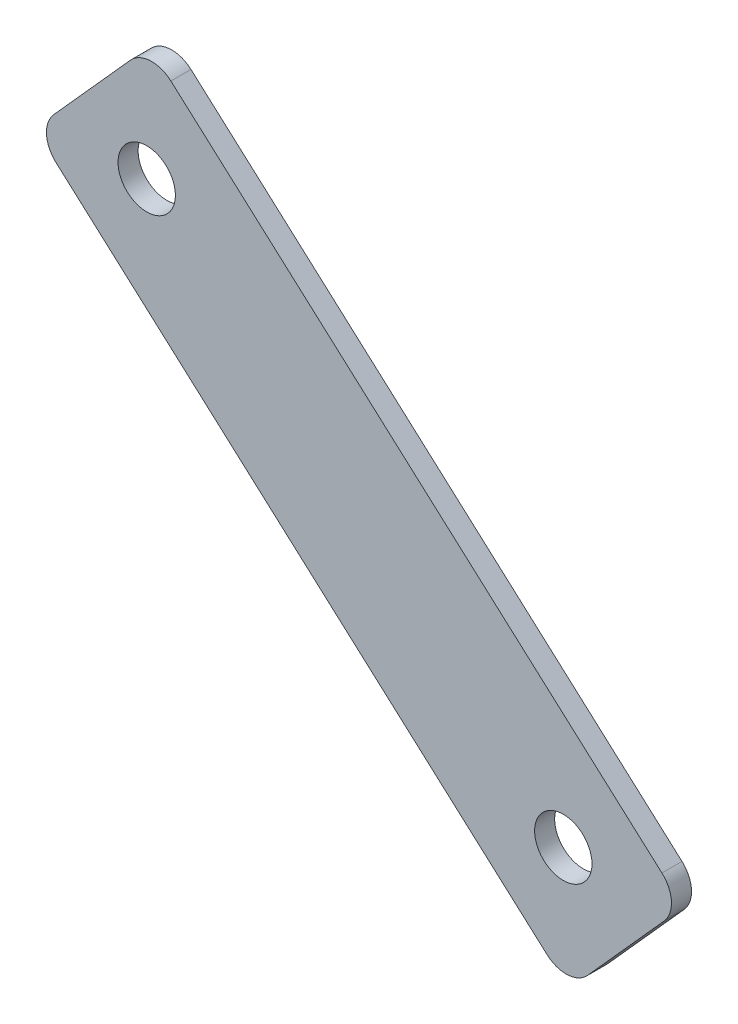
ISO-10303-21;
HEADER;
FILE_DESCRIPTION(('STEP AP214'),'2;1');
FILE_NAME('part.step','',(''),(''),'','','');
FILE_SCHEMA(('AUTOMOTIVE_DESIGN { 1 0 10303 214 1 1 1 1 }'));
ENDSEC;
DATA;
#1=APPLICATION_CONTEXT('core data for automotive mechanical design processes');
#2=APPLICATION_PROTOCOL_DEFINITION('international standard','automotive_design',2000,#1);
#3=PRODUCT_CONTEXT('',#1,'mechanical');
#4=PRODUCT('Part','Part','',(#3));
#5=PRODUCT_RELATED_PRODUCT_CATEGORY('part','',(#4));
#6=PRODUCT_DEFINITION_FORMATION('','',#4);
#7=PRODUCT_DEFINITION_CONTEXT('part definition',#1,'design');
#8=PRODUCT_DEFINITION('design','',#6,#7);
#9=PRODUCT_DEFINITION_SHAPE('','',#8);
#10=(LENGTH_UNIT() NAMED_UNIT(*) SI_UNIT(.MILLI.,.METRE.));
#11=(NAMED_UNIT(*) PLANE_ANGLE_UNIT() SI_UNIT($,.RADIAN.));
#12=(NAMED_UNIT(*) SI_UNIT($,.STERADIAN.) SOLID_ANGLE_UNIT());
#13=UNCERTAINTY_MEASURE_WITH_UNIT(LENGTH_MEASURE(1.E-05),#10,'distance_accuracy_value','');
#14=(GEOMETRIC_REPRESENTATION_CONTEXT(3) GLOBAL_UNCERTAINTY_ASSIGNED_CONTEXT((#13)) GLOBAL_UNIT_ASSIGNED_CONTEXT((#10,
#11,#12)) REPRESENTATION_CONTEXT('',''));
#15=CARTESIAN_POINT('',(0.,0.,0.));
#16=DIRECTION('',(0.,0.,1.));
#17=DIRECTION('',(1.,0.,0.));
#18=AXIS2_PLACEMENT_3D('',#15,#16,#17);
#19=CARTESIAN_POINT('',(-43.7818529659126,63.4547708478243,4.9));
#20=DIRECTION('',(0.667646304647423,0.744478617483833,0.));
#21=DIRECTION('',(-0.744478617483833,0.667646304647423,0.));
#22=AXIS2_PLACEMENT_3D('',#19,#20,#21);
#23=PLANE('',#22);
#24=DIRECTION('',(0.744478617483833,-0.667646304647423,0.));
#25=VECTOR('',#24,1.);
#26=CARTESIAN_POINT('',(-43.7818529659126,63.4547708478243,2.1));
#27=LINE('',#26,#25);
#28=CARTESIAN_POINT('',(-115.251800244361,127.548816093977,2.1));
#29=VERTEX_POINT('',#28);
#30=CARTESIAN_POINT('',(-46.759767435848,66.125356066414,2.1));
#31=VERTEX_POINT('',#30);
#32=EDGE_CURVE('E138',#29,#31,#27,.T.);
#33=ORIENTED_EDGE('',*,*,#32,.T.);
#34=DIRECTION('',(0.,0.,-1.));
#35=VECTOR('',#34,1.);
#36=CARTESIAN_POINT('',(-46.759767435848,66.125356066414,4.9));
#37=LINE('',#36,#35);
#38=CARTESIAN_POINT('',(-46.759767435848,66.125356066414,4.9));
#39=VERTEX_POINT('',#38);
#40=EDGE_CURVE('E113',#31,#39,#37,.F.);
#41=ORIENTED_EDGE('',*,*,#40,.T.);
#42=DIRECTION('',(0.744478617483833,-0.667646304647423,0.));
#43=VECTOR('',#42,1.);
#44=CARTESIAN_POINT('',(-43.7818529659126,63.4547708478243,4.9));
#45=LINE('',#44,#43);
#46=CARTESIAN_POINT('',(-115.251800244361,127.548816093977,4.9));
#47=VERTEX_POINT('',#46);
#48=EDGE_CURVE('E151',#47,#39,#45,.T.);
#49=ORIENTED_EDGE('',*,*,#48,.F.);
#50=DIRECTION('',(0.,0.,-1.));
#51=VECTOR('',#50,1.);
#52=CARTESIAN_POINT('',(-115.251800244361,127.548816093977,4.9));
#53=LINE('',#52,#51);
#54=EDGE_CURVE('E119',#47,#29,#53,.T.);
#55=ORIENTED_EDGE('',*,*,#54,.T.);
#56=EDGE_LOOP('',(#33,#41,#49,#55));
#57=FACE_BOUND('',#56,.T.);
#58=ADVANCED_FACE('F42',(#57),#23,.F.);
#59=CARTESIAN_POINT('',(-43.7818529659126,63.4547708478243,4.9));
#60=DIRECTION('',(-0.744478617483833,0.667646304647423,0.));
#61=DIRECTION('',(-0.667646304647423,-0.744478617483833,0.));
#62=AXIS2_PLACEMENT_3D('',#59,#60,#61);
#63=PLANE('',#62);
#64=DIRECTION('',(0.667646304647423,0.744478617483833,0.));
#65=VECTOR('',#64,1.);
#66=CARTESIAN_POINT('',(-43.7818529659126,63.4547708478243,4.9));
#67=LINE('',#66,#65);
#68=CARTESIAN_POINT('',(-41.1112677473229,66.4326853177597,4.9));
#69=VERTEX_POINT('',#68);
#70=CARTESIAN_POINT('',(-30.4289268729642,78.344343197501,4.9));
#71=VERTEX_POINT('',#70);
#72=EDGE_CURVE('E129',#69,#71,#67,.T.);
#73=ORIENTED_EDGE('',*,*,#72,.F.);
#74=DIRECTION('',(0.,0.,-1.));
#75=VECTOR('',#74,1.);
#76=CARTESIAN_POINT('',(-41.1112677473229,66.4326853177597,4.9));
#77=LINE('',#76,#75);
#78=CARTESIAN_POINT('',(-41.1112677473229,66.4326853177597,2.1));
#79=VERTEX_POINT('',#78);
#80=EDGE_CURVE('E112',#69,#79,#77,.T.);
#81=ORIENTED_EDGE('',*,*,#80,.T.);
#82=DIRECTION('',(0.667646304647423,0.744478617483833,0.));
#83=VECTOR('',#82,1.);
#84=CARTESIAN_POINT('',(-43.7818529659126,63.4547708478243,2.1));
#85=LINE('',#84,#83);
#86=CARTESIAN_POINT('',(-30.4289268729642,78.344343197501,2.1));
#87=VERTEX_POINT('',#86);
#88=EDGE_CURVE('E126',#79,#87,#85,.T.);
#89=ORIENTED_EDGE('',*,*,#88,.T.);
#90=DIRECTION('',(0.,0.,-1.));
#91=VECTOR('',#90,1.);
#92=CARTESIAN_POINT('',(-30.4289268729642,78.344343197501,4.9));
#93=LINE('',#92,#91);
#94=EDGE_CURVE('E132',#87,#71,#93,.F.);
#95=ORIENTED_EDGE('',*,*,#94,.T.);
#96=EDGE_LOOP('',(#73,#81,#89,#95));
#97=FACE_BOUND('',#96,.T.);
#98=ADVANCED_FACE('F125',(#97),#63,.F.);
#99=CARTESIAN_POINT('',(-27.7583416543745,81.3222576674363,4.9));
#100=DIRECTION('',(-0.667646304647423,-0.744478617483833,0.));
#101=DIRECTION('',(0.744478617483833,-0.667646304647423,0.));
#102=AXIS2_PLACEMENT_3D('',#99,#100,#101);
#103=PLANE('',#102);
#104=DIRECTION('',(-0.744478617483833,0.667646304647423,0.));
#105=VECTOR('',#104,1.);
#106=CARTESIAN_POINT('',(-27.7583416543745,81.3222576674363,4.9));
#107=LINE('',#106,#105);
#108=CARTESIAN_POINT('',(-30.7362561243098,83.992842886026,4.9));
#109=VERTEX_POINT('',#108);
#110=CARTESIAN_POINT('',(-99.2282889328225,145.416302913589,4.9));
#111=VERTEX_POINT('',#110);
#112=EDGE_CURVE('E200',#109,#111,#107,.T.);
#113=ORIENTED_EDGE('',*,*,#112,.F.);
#114=DIRECTION('',(0.,0.,-1.));
#115=VECTOR('',#114,1.);
#116=CARTESIAN_POINT('',(-30.7362561243098,83.992842886026,4.9));
#117=LINE('',#116,#115);
#118=CARTESIAN_POINT('',(-30.7362561243098,83.992842886026,2.1));
#119=VERTEX_POINT('',#118);
#120=EDGE_CURVE('E181',#109,#119,#117,.T.);
#121=ORIENTED_EDGE('',*,*,#120,.T.);
#122=DIRECTION('',(-0.744478617483833,0.667646304647423,0.));
#123=VECTOR('',#122,1.);
#124=CARTESIAN_POINT('',(-27.7583416543745,81.3222576674363,2.1));
#125=LINE('',#124,#123);
#126=CARTESIAN_POINT('',(-99.2282889328225,145.416302913589,2.1));
#127=VERTEX_POINT('',#126);
#128=EDGE_CURVE('E137',#119,#127,#125,.T.);
#129=ORIENTED_EDGE('',*,*,#128,.T.);
#130=DIRECTION('',(0.,0.,-1.));
#131=VECTOR('',#130,1.);
#132=CARTESIAN_POINT('',(-99.2282889328224,145.416302913589,4.9));
#133=LINE('',#132,#131);
#134=EDGE_CURVE('E178',#127,#111,#133,.F.);
#135=ORIENTED_EDGE('',*,*,#134,.T.);
#136=EDGE_LOOP('',(#113,#121,#129,#135));
#137=FACE_BOUND('',#136,.T.);
#138=ADVANCED_FACE('F218',(#137),#103,.F.);
#139=CARTESIAN_POINT('',(-118.229714714296,130.219401312567,4.9));
#140=DIRECTION('',(0.744478617483833,-0.667646304647424,0.));
#141=DIRECTION('',(0.667646304647424,0.744478617483833,0.));
#142=AXIS2_PLACEMENT_3D('',#139,#140,#141);
#143=PLANE('',#142);
#144=DIRECTION('',(-0.667646304647424,-0.744478617483833,0.));
#145=VECTOR('',#144,1.);
#146=CARTESIAN_POINT('',(-118.229714714296,130.219401312567,2.1));
#147=LINE('',#146,#145);
#148=CARTESIAN_POINT('',(-104.876788621347,145.108973662243,2.1));
#149=VERTEX_POINT('',#148);
#150=CARTESIAN_POINT('',(-115.559129495706,133.197315782502,2.1));
#151=VERTEX_POINT('',#150);
#152=EDGE_CURVE('E143',#149,#151,#147,.T.);
#153=ORIENTED_EDGE('',*,*,#152,.T.);
#154=DIRECTION('',(0.,0.,-1.));
#155=VECTOR('',#154,1.);
#156=CARTESIAN_POINT('',(-115.559129495706,133.197315782502,4.9));
#157=LINE('',#156,#155);
#158=CARTESIAN_POINT('',(-115.559129495706,133.197315782502,4.9));
#159=VERTEX_POINT('',#158);
#160=EDGE_CURVE('E11',#151,#159,#157,.F.);
#161=ORIENTED_EDGE('',*,*,#160,.T.);
#162=DIRECTION('',(-0.667646304647424,-0.744478617483833,0.));
#163=VECTOR('',#162,1.);
#164=CARTESIAN_POINT('',(-118.229714714296,130.219401312567,4.9));
#165=LINE('',#164,#163);
#166=CARTESIAN_POINT('',(-104.876788621347,145.108973662243,4.9));
#167=VERTEX_POINT('',#166);
#168=EDGE_CURVE('E153',#167,#159,#165,.T.);
#169=ORIENTED_EDGE('',*,*,#168,.F.);
#170=DIRECTION('',(0.,0.,-1.));
#171=VECTOR('',#170,1.);
#172=CARTESIAN_POINT('',(-104.876788621347,145.108973662243,4.9));
#173=LINE('',#172,#171);
#174=EDGE_CURVE('E51',#167,#149,#173,.T.);
#175=ORIENTED_EDGE('',*,*,#174,.T.);
#176=EDGE_LOOP('',(#153,#161,#169,#175));
#177=FACE_BOUND('',#176,.T.);
#178=ADVANCED_FACE('F188',(#177),#143,.F.);
#179=CARTESIAN_POINT('',(-43.7818529659126,63.4547708478243,4.9));
#180=DIRECTION('',(0.,0.,-1.));
#181=DIRECTION('',(-1.,0.,0.));
#182=AXIS2_PLACEMENT_3D('',#179,#180,#181);
#183=PLANE('',#182);
#184=CARTESIAN_POINT('',(-44.4932734037702,80.2114337437297,4.9));
#185=DIRECTION('',(0.,0.,1.));
#186=DIRECTION('',(1.,0.,0.));
#187=AXIS2_PLACEMENT_3D('',#184,#185,#186);
#188=CIRCLE('',#187,4.);
#189=CARTESIAN_POINT('',(-40.4932734037702,80.2114337437297,4.9));
#190=VERTEX_POINT('',#189);
#191=EDGE_CURVE('E347',#190,#190,#188,.T.);
#192=ORIENTED_EDGE('',*,*,#191,.F.);
#193=EDGE_LOOP('',(#192));
#194=FACE_BOUND('',#193,.T.);
#195=CARTESIAN_POINT('',(-102.598565967291,131.915833164221,4.9));
#196=DIRECTION('',(0.,0.,1.));
#197=DIRECTION('',(1.,0.,0.));
#198=AXIS2_PLACEMENT_3D('',#195,#196,#197);
#199=CIRCLE('',#198,4.);
#200=CARTESIAN_POINT('',(-98.5985659672906,131.915833164221,4.9));
#201=VERTEX_POINT('',#200);
#202=EDGE_CURVE('E349',#201,#201,#199,.T.);
#203=ORIENTED_EDGE('',*,*,#202,.F.);
#204=EDGE_LOOP('',(#203));
#205=FACE_BOUND('',#204,.T.);
#206=ORIENTED_EDGE('',*,*,#48,.T.);
#207=CARTESIAN_POINT('',(-44.0891822172583,69.1032705363494,4.9));
#208=DIRECTION('',(0.,0.,-1.));
#209=DIRECTION('',(-1.,0.,0.));
#210=AXIS2_PLACEMENT_3D('',#207,#208,#209);
#211=CIRCLE('',#210,4.);
#212=EDGE_CURVE('E175',#39,#69,#211,.F.);
#213=ORIENTED_EDGE('',*,*,#212,.T.);
#214=ORIENTED_EDGE('',*,*,#72,.T.);
#215=CARTESIAN_POINT('',(-33.4068413428995,81.0149284160907,4.9));
#216=DIRECTION('',(0.,0.,-1.));
#217=DIRECTION('',(-1.,0.,0.));
#218=AXIS2_PLACEMENT_3D('',#215,#216,#217);
#219=CIRCLE('',#218,4.);
#220=EDGE_CURVE('E172',#71,#109,#219,.F.);
#221=ORIENTED_EDGE('',*,*,#220,.T.);
#222=ORIENTED_EDGE('',*,*,#112,.T.);
#223=CARTESIAN_POINT('',(-101.898874151412,142.438388443654,4.9));
#224=DIRECTION('',(0.,0.,-1.));
#225=DIRECTION('',(-1.,0.,0.));
#226=AXIS2_PLACEMENT_3D('',#223,#224,#225);
#227=CIRCLE('',#226,4.);
#228=EDGE_CURVE('E63',#111,#167,#227,.F.);
#229=ORIENTED_EDGE('',*,*,#228,.T.);
#230=ORIENTED_EDGE('',*,*,#168,.T.);
#231=CARTESIAN_POINT('',(-112.581215025771,130.526730563912,4.9));
#232=DIRECTION('',(0.,0.,-1.));
#233=DIRECTION('',(-1.,0.,0.));
#234=AXIS2_PLACEMENT_3D('',#231,#232,#233);
#235=CIRCLE('',#234,4.);
#236=EDGE_CURVE('E169',#159,#47,#235,.F.);
#237=ORIENTED_EDGE('',*,*,#236,.T.);
#238=EDGE_LOOP('',(#206,#213,#214,#221,#222,#229,#230,#237));
#239=FACE_BOUND('',#238,.T.);
#240=ADVANCED_FACE('F208',(#194,#205,#239),#183,.F.);
#241=CARTESIAN_POINT('',(-43.7818529659126,63.4547708478243,2.1));
#242=DIRECTION('',(0.,0.,-1.));
#243=DIRECTION('',(-1.,0.,0.));
#244=AXIS2_PLACEMENT_3D('',#241,#242,#243);
#245=PLANE('',#244);
#246=CARTESIAN_POINT('',(-44.4932734037702,80.2114337437297,2.1));
#247=DIRECTION('',(0.,0.,1.));
#248=DIRECTION('',(1.,0.,0.));
#249=AXIS2_PLACEMENT_3D('',#246,#247,#248);
#250=CIRCLE('',#249,4.);
#251=CARTESIAN_POINT('',(-40.4932734037702,80.2114337437297,2.1));
#252=VERTEX_POINT('',#251);
#253=EDGE_CURVE('E145',#252,#252,#250,.T.);
#254=ORIENTED_EDGE('',*,*,#253,.T.);
#255=EDGE_LOOP('',(#254));
#256=FACE_BOUND('',#255,.T.);
#257=CARTESIAN_POINT('',(-102.598565967291,131.915833164221,2.1));
#258=DIRECTION('',(0.,0.,1.));
#259=DIRECTION('',(1.,0.,0.));
#260=AXIS2_PLACEMENT_3D('',#257,#258,#259);
#261=CIRCLE('',#260,4.);
#262=CARTESIAN_POINT('',(-98.5985659672906,131.915833164221,2.1));
#263=VERTEX_POINT('',#262);
#264=EDGE_CURVE('E203',#263,#263,#261,.T.);
#265=ORIENTED_EDGE('',*,*,#264,.T.);
#266=EDGE_LOOP('',(#265));
#267=FACE_BOUND('',#266,.T.);
#268=ORIENTED_EDGE('',*,*,#88,.F.);
#269=CARTESIAN_POINT('',(-44.0891822172583,69.1032705363494,2.1));
#270=DIRECTION('',(0.,0.,-1.));
#271=DIRECTION('',(-1.,0.,0.));
#272=AXIS2_PLACEMENT_3D('',#269,#270,#271);
#273=CIRCLE('',#272,4.);
#274=EDGE_CURVE('E108',#79,#31,#273,.T.);
#275=ORIENTED_EDGE('',*,*,#274,.T.);
#276=ORIENTED_EDGE('',*,*,#32,.F.);
#277=CARTESIAN_POINT('',(-112.581215025771,130.526730563912,2.1));
#278=DIRECTION('',(0.,0.,-1.));
#279=DIRECTION('',(-1.,0.,0.));
#280=AXIS2_PLACEMENT_3D('',#277,#278,#279);
#281=CIRCLE('',#280,4.);
#282=EDGE_CURVE('E157',#29,#151,#281,.T.);
#283=ORIENTED_EDGE('',*,*,#282,.T.);
#284=ORIENTED_EDGE('',*,*,#152,.F.);
#285=CARTESIAN_POINT('',(-101.898874151412,142.438388443654,2.1));
#286=DIRECTION('',(0.,0.,-1.));
#287=DIRECTION('',(-1.,0.,0.));
#288=AXIS2_PLACEMENT_3D('',#285,#286,#287);
#289=CIRCLE('',#288,4.);
#290=EDGE_CURVE('E131',#149,#127,#289,.T.);
#291=ORIENTED_EDGE('',*,*,#290,.T.);
#292=ORIENTED_EDGE('',*,*,#128,.F.);
#293=CARTESIAN_POINT('',(-33.4068413428995,81.0149284160907,2.1));
#294=DIRECTION('',(0.,0.,-1.));
#295=DIRECTION('',(-1.,0.,0.));
#296=AXIS2_PLACEMENT_3D('',#293,#294,#295);
#297=CIRCLE('',#296,4.);
#298=EDGE_CURVE('E120',#119,#87,#297,.T.);
#299=ORIENTED_EDGE('',*,*,#298,.T.);
#300=EDGE_LOOP('',(#268,#275,#276,#283,#284,#291,#292,#299));
#301=FACE_BOUND('',#300,.T.);
#302=ADVANCED_FACE('F134',(#256,#267,#301),#245,.T.);
#303=CARTESIAN_POINT('',(-44.0891822172583,69.1032705363494,4.9));
#304=DIRECTION('',(0.,0.,-1.));
#305=DIRECTION('',(-1.,0.,0.));
#306=AXIS2_PLACEMENT_3D('',#303,#304,#305);
#307=CYLINDRICAL_SURFACE('',#306,4.);
#308=ORIENTED_EDGE('',*,*,#212,.F.);
#309=ORIENTED_EDGE('',*,*,#40,.F.);
#310=ORIENTED_EDGE('',*,*,#274,.F.);
#311=ORIENTED_EDGE('',*,*,#80,.F.);
#312=EDGE_LOOP('',(#308,#309,#310,#311));
#313=FACE_BOUND('',#312,.T.);
#314=ADVANCED_FACE('F111',(#313),#307,.T.);
#315=CARTESIAN_POINT('',(-33.4068413428995,81.0149284160907,4.9));
#316=DIRECTION('',(0.,0.,-1.));
#317=DIRECTION('',(-1.,0.,0.));
#318=AXIS2_PLACEMENT_3D('',#315,#316,#317);
#319=CYLINDRICAL_SURFACE('',#318,4.);
#320=ORIENTED_EDGE('',*,*,#220,.F.);
#321=ORIENTED_EDGE('',*,*,#94,.F.);
#322=ORIENTED_EDGE('',*,*,#298,.F.);
#323=ORIENTED_EDGE('',*,*,#120,.F.);
#324=EDGE_LOOP('',(#320,#321,#322,#323));
#325=FACE_BOUND('',#324,.T.);
#326=ADVANCED_FACE('F233',(#325),#319,.T.);
#327=CARTESIAN_POINT('',(-112.581215025771,130.526730563912,4.9));
#328=DIRECTION('',(0.,0.,-1.));
#329=DIRECTION('',(-1.,0.,0.));
#330=AXIS2_PLACEMENT_3D('',#327,#328,#329);
#331=CYLINDRICAL_SURFACE('',#330,4.);
#332=ORIENTED_EDGE('',*,*,#236,.F.);
#333=ORIENTED_EDGE('',*,*,#160,.F.);
#334=ORIENTED_EDGE('',*,*,#282,.F.);
#335=ORIENTED_EDGE('',*,*,#54,.F.);
#336=EDGE_LOOP('',(#332,#333,#334,#335));
#337=FACE_BOUND('',#336,.T.);
#338=ADVANCED_FACE('F193',(#337),#331,.T.);
#339=CARTESIAN_POINT('',(-101.898874151412,142.438388443654,4.9));
#340=DIRECTION('',(0.,0.,-1.));
#341=DIRECTION('',(-1.,0.,0.));
#342=AXIS2_PLACEMENT_3D('',#339,#340,#341);
#343=CYLINDRICAL_SURFACE('',#342,4.);
#344=ORIENTED_EDGE('',*,*,#228,.F.);
#345=ORIENTED_EDGE('',*,*,#134,.F.);
#346=ORIENTED_EDGE('',*,*,#290,.F.);
#347=ORIENTED_EDGE('',*,*,#174,.F.);
#348=EDGE_LOOP('',(#344,#345,#346,#347));
#349=FACE_BOUND('',#348,.T.);
#350=ADVANCED_FACE('F44',(#349),#343,.T.);
#351=CARTESIAN_POINT('',(-102.598565967291,131.915833164221,2.1));
#352=DIRECTION('',(0.,0.,1.));
#353=DIRECTION('',(1.,0.,0.));
#354=AXIS2_PLACEMENT_3D('',#351,#352,#353);
#355=CYLINDRICAL_SURFACE('',#354,4.);
#356=ORIENTED_EDGE('',*,*,#264,.F.);
#357=EDGE_LOOP('',(#356));
#358=FACE_BOUND('',#357,.T.);
#359=ORIENTED_EDGE('',*,*,#202,.T.);
#360=EDGE_LOOP('',(#359));
#361=FACE_BOUND('',#360,.T.);
#362=ADVANCED_FACE('F240',(#358,#361),#355,.F.);
#363=CARTESIAN_POINT('',(-44.4932734037702,80.2114337437297,2.1));
#364=DIRECTION('',(0.,0.,1.));
#365=DIRECTION('',(1.,0.,0.));
#366=AXIS2_PLACEMENT_3D('',#363,#364,#365);
#367=CYLINDRICAL_SURFACE('',#366,4.);
#368=ORIENTED_EDGE('',*,*,#253,.F.);
#369=EDGE_LOOP('',(#368));
#370=FACE_BOUND('',#369,.T.);
#371=ORIENTED_EDGE('',*,*,#191,.T.);
#372=EDGE_LOOP('',(#371));
#373=FACE_BOUND('',#372,.T.);
#374=ADVANCED_FACE('F244',(#370,#373),#367,.F.);
#375=CLOSED_SHELL('',(#58,#98,#138,#178,#240,#302,#314,#326,#338,#350,#362,#374));
#376=MANIFOLD_SOLID_BREP('B2',#375);
#377=ADVANCED_BREP_SHAPE_REPRESENTATION('',(#18,#376),#14);
#378=SHAPE_DEFINITION_REPRESENTATION(#9,#377);
ENDSEC;
END-ISO-10303-21;
